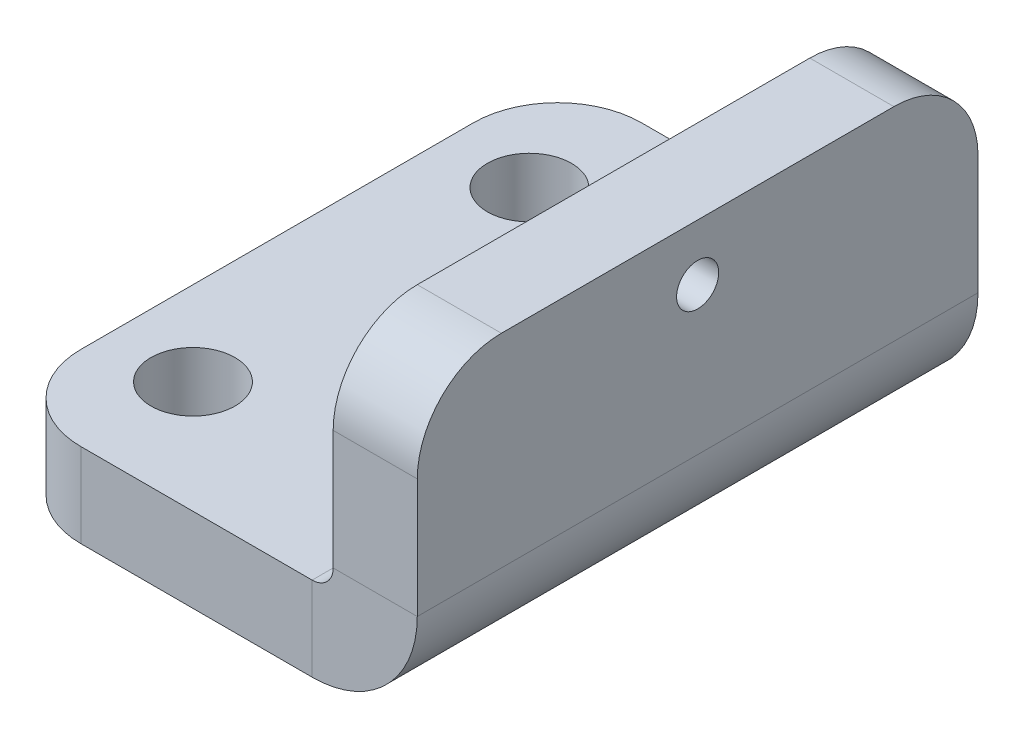
ISO-10303-21;
HEADER;
FILE_DESCRIPTION(('STEP AP214'),'2;1');
FILE_NAME('part.step','',(''),(''),'','','');
FILE_SCHEMA(('AUTOMOTIVE_DESIGN { 1 0 10303 214 1 1 1 1 }'));
ENDSEC;
DATA;
#1=APPLICATION_CONTEXT('core data for automotive mechanical design processes');
#2=APPLICATION_PROTOCOL_DEFINITION('international standard','automotive_design',2000,#1);
#3=PRODUCT_CONTEXT('',#1,'mechanical');
#4=PRODUCT('Part','Part','',(#3));
#5=PRODUCT_RELATED_PRODUCT_CATEGORY('part','',(#4));
#6=PRODUCT_DEFINITION_FORMATION('','',#4);
#7=PRODUCT_DEFINITION_CONTEXT('part definition',#1,'design');
#8=PRODUCT_DEFINITION('design','',#6,#7);
#9=PRODUCT_DEFINITION_SHAPE('','',#8);
#10=(LENGTH_UNIT() NAMED_UNIT(*) SI_UNIT(.MILLI.,.METRE.));
#11=(NAMED_UNIT(*) PLANE_ANGLE_UNIT() SI_UNIT($,.RADIAN.));
#12=(NAMED_UNIT(*) SI_UNIT($,.STERADIAN.) SOLID_ANGLE_UNIT());
#13=UNCERTAINTY_MEASURE_WITH_UNIT(LENGTH_MEASURE(1.E-05),#10,'distance_accuracy_value','');
#14=(GEOMETRIC_REPRESENTATION_CONTEXT(3) GLOBAL_UNCERTAINTY_ASSIGNED_CONTEXT((#13)) GLOBAL_UNIT_ASSIGNED_CONTEXT((#10,
#11,#12)) REPRESENTATION_CONTEXT('',''));
#15=CARTESIAN_POINT('',(0.,0.,0.));
#16=DIRECTION('',(0.,0.,1.));
#17=DIRECTION('',(1.,0.,0.));
#18=AXIS2_PLACEMENT_3D('',#15,#16,#17);
#19=CARTESIAN_POINT('',(0.,0.75,10.));
#20=DIRECTION('',(0.,0.,1.));
#21=DIRECTION('',(1.,0.,0.));
#22=AXIS2_PLACEMENT_3D('',#19,#20,#21);
#23=PLANE('',#22);
#24=DIRECTION('',(1.,0.,0.));
#25=VECTOR('',#24,1.);
#26=CARTESIAN_POINT('',(0.,0.75,10.));
#27=LINE('',#26,#25);
#28=CARTESIAN_POINT('',(0.,0.75,10.));
#29=VERTEX_POINT('',#28);
#30=CARTESIAN_POINT('',(3.,0.75,10.));
#31=VERTEX_POINT('',#30);
#32=EDGE_CURVE('E132',#29,#31,#27,.T.);
#33=ORIENTED_EDGE('',*,*,#32,.F.);
#34=CARTESIAN_POINT('',(-0.75,0.75,10.));
#35=DIRECTION('',(0.,0.,-1.));
#36=DIRECTION('',(-1.,0.,0.));
#37=AXIS2_PLACEMENT_3D('',#34,#35,#36);
#38=CIRCLE('',#37,0.75);
#39=CARTESIAN_POINT('',(-0.750000000000001,0.,10.));
#40=VERTEX_POINT('',#39);
#41=EDGE_CURVE('E136',#40,#29,#38,.F.);
#42=ORIENTED_EDGE('',*,*,#41,.F.);
#43=DIRECTION('',(0.,1.,0.));
#44=VECTOR('',#43,1.);
#45=CARTESIAN_POINT('',(-0.750000000000001,-3.,10.));
#46=LINE('',#45,#44);
#47=CARTESIAN_POINT('',(-0.750000000000001,-3.,10.));
#48=VERTEX_POINT('',#47);
#49=EDGE_CURVE('E141',#48,#40,#46,.T.);
#50=ORIENTED_EDGE('',*,*,#49,.F.);
#51=CARTESIAN_POINT('',(-0.75,0.75,10.));
#52=DIRECTION('',(0.,0.,1.));
#53=DIRECTION('',(1.,0.,0.));
#54=AXIS2_PLACEMENT_3D('',#51,#52,#53);
#55=CIRCLE('',#54,3.75);
#56=EDGE_CURVE('E138',#48,#31,#55,.T.);
#57=ORIENTED_EDGE('',*,*,#56,.T.);
#58=EDGE_LOOP('',(#33,#42,#50,#57));
#59=FACE_BOUND('',#58,.T.);
#60=ADVANCED_FACE('F39',(#59),#23,.T.);
#61=CARTESIAN_POINT('',(-0.750000000000001,-3.,10.));
#62=DIRECTION('',(0.,0.,1.));
#63=DIRECTION('',(1.,0.,0.));
#64=AXIS2_PLACEMENT_3D('',#61,#62,#63);
#65=PLANE('',#64);
#66=DIRECTION('',(0.,1.,0.));
#67=VECTOR('',#66,1.);
#68=CARTESIAN_POINT('',(3.,0.,10.));
#69=LINE('',#68,#67);
#70=CARTESIAN_POINT('',(3.,5.,10.));
#71=VERTEX_POINT('',#70);
#72=EDGE_CURVE('E156',#31,#71,#69,.T.);
#73=ORIENTED_EDGE('',*,*,#72,.T.);
#74=DIRECTION('',(1.,0.,0.));
#75=VECTOR('',#74,1.);
#76=CARTESIAN_POINT('',(-0.750000000000001,5.,10.));
#77=LINE('',#76,#75);
#78=CARTESIAN_POINT('',(0.,5.,10.));
#79=VERTEX_POINT('',#78);
#80=EDGE_CURVE('E62',#71,#79,#77,.F.);
#81=ORIENTED_EDGE('',*,*,#80,.T.);
#82=DIRECTION('',(0.,1.,0.));
#83=VECTOR('',#82,1.);
#84=CARTESIAN_POINT('',(0.,0.,10.));
#85=LINE('',#84,#83);
#86=EDGE_CURVE('E146',#29,#79,#85,.T.);
#87=ORIENTED_EDGE('',*,*,#86,.F.);
#88=ORIENTED_EDGE('',*,*,#32,.T.);
#89=EDGE_LOOP('',(#73,#81,#87,#88));
#90=FACE_BOUND('',#89,.T.);
#91=ADVANCED_FACE('F155',(#90),#65,.T.);
#92=CARTESIAN_POINT('',(-0.750000000000001,0.,-10.));
#93=DIRECTION('',(0.,0.,-1.));
#94=DIRECTION('',(-1.,0.,0.));
#95=AXIS2_PLACEMENT_3D('',#92,#93,#94);
#96=PLANE('',#95);
#97=DIRECTION('',(0.,-1.,0.));
#98=VECTOR('',#97,1.);
#99=CARTESIAN_POINT('',(-0.750000000000001,0.,-10.));
#100=LINE('',#99,#98);
#101=CARTESIAN_POINT('',(-0.750000000000001,0.,-10.));
#102=VERTEX_POINT('',#101);
#103=CARTESIAN_POINT('',(-0.750000000000001,-3.,-10.));
#104=VERTEX_POINT('',#103);
#105=EDGE_CURVE('E202',#102,#104,#100,.T.);
#106=ORIENTED_EDGE('',*,*,#105,.F.);
#107=CARTESIAN_POINT('',(-0.75,0.75,-10.));
#108=DIRECTION('',(0.,0.,-1.));
#109=DIRECTION('',(-1.,0.,0.));
#110=AXIS2_PLACEMENT_3D('',#107,#108,#109);
#111=CIRCLE('',#110,0.75);
#112=CARTESIAN_POINT('',(0.,0.75,-10.));
#113=VERTEX_POINT('',#112);
#114=EDGE_CURVE('E175',#102,#113,#111,.F.);
#115=ORIENTED_EDGE('',*,*,#114,.T.);
#116=DIRECTION('',(-1.,0.,0.));
#117=VECTOR('',#116,1.);
#118=CARTESIAN_POINT('',(3.,0.75,-10.));
#119=LINE('',#118,#117);
#120=CARTESIAN_POINT('',(3.,0.75,-10.));
#121=VERTEX_POINT('',#120);
#122=EDGE_CURVE('E200',#121,#113,#119,.T.);
#123=ORIENTED_EDGE('',*,*,#122,.F.);
#124=CARTESIAN_POINT('',(-0.75,0.75,-10.));
#125=DIRECTION('',(0.,0.,1.));
#126=DIRECTION('',(1.,0.,0.));
#127=AXIS2_PLACEMENT_3D('',#124,#125,#126);
#128=CIRCLE('',#127,3.75);
#129=EDGE_CURVE('E181',#104,#121,#128,.T.);
#130=ORIENTED_EDGE('',*,*,#129,.F.);
#131=EDGE_LOOP('',(#106,#115,#123,#130));
#132=FACE_BOUND('',#131,.T.);
#133=ADVANCED_FACE('F286',(#132),#96,.T.);
#134=CARTESIAN_POINT('',(3.,0.75,-10.));
#135=DIRECTION('',(0.,0.,-1.));
#136=DIRECTION('',(-1.,0.,0.));
#137=AXIS2_PLACEMENT_3D('',#134,#135,#136);
#138=PLANE('',#137);
#139=DIRECTION('',(1.,0.,0.));
#140=VECTOR('',#139,1.);
#141=CARTESIAN_POINT('',(-12.,-3.,-10.));
#142=LINE('',#141,#140);
#143=CARTESIAN_POINT('',(-9.,-3.,-10.));
#144=VERTEX_POINT('',#143);
#145=EDGE_CURVE('E179',#144,#104,#142,.T.);
#146=ORIENTED_EDGE('',*,*,#145,.F.);
#147=DIRECTION('',(0.,1.,0.));
#148=VECTOR('',#147,1.);
#149=CARTESIAN_POINT('',(-9.,0.75,-10.));
#150=LINE('',#149,#148);
#151=CARTESIAN_POINT('',(-9.,0.,-10.));
#152=VERTEX_POINT('',#151);
#153=EDGE_CURVE('E140',#144,#152,#150,.T.);
#154=ORIENTED_EDGE('',*,*,#153,.T.);
#155=DIRECTION('',(1.,0.,0.));
#156=VECTOR('',#155,1.);
#157=CARTESIAN_POINT('',(-12.,0.,-10.));
#158=LINE('',#157,#156);
#159=EDGE_CURVE('E177',#152,#102,#158,.T.);
#160=ORIENTED_EDGE('',*,*,#159,.T.);
#161=ORIENTED_EDGE('',*,*,#105,.T.);
#162=EDGE_LOOP('',(#146,#154,#160,#161));
#163=FACE_BOUND('',#162,.T.);
#164=ADVANCED_FACE('F333',(#163),#138,.T.);
#165=CARTESIAN_POINT('',(3.,0.,10.));
#166=DIRECTION('',(-1.,0.,0.));
#167=DIRECTION('',(0.,0.,1.));
#168=AXIS2_PLACEMENT_3D('',#165,#166,#167);
#169=PLANE('',#168);
#170=CARTESIAN_POINT('',(3.,6.,0.));
#171=DIRECTION('',(-1.,0.,0.));
#172=DIRECTION('',(0.,0.,1.));
#173=AXIS2_PLACEMENT_3D('',#170,#171,#172);
#174=CIRCLE('',#173,0.75);
#175=CARTESIAN_POINT('',(3.,6.,0.75));
#176=VERTEX_POINT('',#175);
#177=EDGE_CURVE('E250',#176,#176,#174,.T.);
#178=ORIENTED_EDGE('',*,*,#177,.T.);
#179=EDGE_LOOP('',(#178));
#180=FACE_BOUND('',#179,.T.);
#181=DIRECTION('',(0.,0.,-1.));
#182=VECTOR('',#181,1.);
#183=CARTESIAN_POINT('',(3.,8.,10.));
#184=LINE('',#183,#182);
#185=CARTESIAN_POINT('',(3.,8.,7.));
#186=VERTEX_POINT('',#185);
#187=CARTESIAN_POINT('',(3.,8.,-7.));
#188=VERTEX_POINT('',#187);
#189=EDGE_CURVE('E197',#186,#188,#184,.T.);
#190=ORIENTED_EDGE('',*,*,#189,.F.);
#191=CARTESIAN_POINT('',(3.,5.,7.));
#192=DIRECTION('',(-1.,0.,0.));
#193=DIRECTION('',(0.,0.,1.));
#194=AXIS2_PLACEMENT_3D('',#191,#192,#193);
#195=CIRCLE('',#194,3.);
#196=EDGE_CURVE('E231',#186,#71,#195,.F.);
#197=ORIENTED_EDGE('',*,*,#196,.T.);
#198=ORIENTED_EDGE('',*,*,#72,.F.);
#199=DIRECTION('',(0.,0.,-1.));
#200=VECTOR('',#199,1.);
#201=CARTESIAN_POINT('',(3.,0.75,10.));
#202=LINE('',#201,#200);
#203=EDGE_CURVE('E169',#31,#121,#202,.T.);
#204=ORIENTED_EDGE('',*,*,#203,.T.);
#205=DIRECTION('',(0.,1.,0.));
#206=VECTOR('',#205,1.);
#207=CARTESIAN_POINT('',(3.,0.,-10.));
#208=LINE('',#207,#206);
#209=CARTESIAN_POINT('',(3.,5.,-10.));
#210=VERTEX_POINT('',#209);
#211=EDGE_CURVE('E170',#121,#210,#208,.T.);
#212=ORIENTED_EDGE('',*,*,#211,.T.);
#213=CARTESIAN_POINT('',(3.,5.,-7.));
#214=DIRECTION('',(-1.,0.,0.));
#215=DIRECTION('',(0.,0.,1.));
#216=AXIS2_PLACEMENT_3D('',#213,#214,#215);
#217=CIRCLE('',#216,3.);
#218=EDGE_CURVE('E229',#210,#188,#217,.F.);
#219=ORIENTED_EDGE('',*,*,#218,.T.);
#220=EDGE_LOOP('',(#190,#197,#198,#204,#212,#219));
#221=FACE_BOUND('',#220,.T.);
#222=ADVANCED_FACE('F244',(#180,#221),#169,.F.);
#223=CARTESIAN_POINT('',(0.,8.,10.));
#224=DIRECTION('',(0.,1.,0.));
#225=DIRECTION('',(0.,0.,1.));
#226=AXIS2_PLACEMENT_3D('',#223,#224,#225);
#227=PLANE('',#226);
#228=DIRECTION('',(0.,0.,-1.));
#229=VECTOR('',#228,1.);
#230=CARTESIAN_POINT('',(0.,8.,10.));
#231=LINE('',#230,#229);
#232=CARTESIAN_POINT('',(0.,8.,7.));
#233=VERTEX_POINT('',#232);
#234=CARTESIAN_POINT('',(0.,8.,-7.));
#235=VERTEX_POINT('',#234);
#236=EDGE_CURVE('E152',#233,#235,#231,.T.);
#237=ORIENTED_EDGE('',*,*,#236,.F.);
#238=DIRECTION('',(1.,0.,0.));
#239=VECTOR('',#238,1.);
#240=CARTESIAN_POINT('',(0.,8.,7.));
#241=LINE('',#240,#239);
#242=EDGE_CURVE('E226',#233,#186,#241,.T.);
#243=ORIENTED_EDGE('',*,*,#242,.T.);
#244=ORIENTED_EDGE('',*,*,#189,.T.);
#245=DIRECTION('',(1.,0.,0.));
#246=VECTOR('',#245,1.);
#247=CARTESIAN_POINT('',(0.,8.,-7.));
#248=LINE('',#247,#246);
#249=EDGE_CURVE('E224',#188,#235,#248,.F.);
#250=ORIENTED_EDGE('',*,*,#249,.T.);
#251=EDGE_LOOP('',(#237,#243,#244,#250));
#252=FACE_BOUND('',#251,.T.);
#253=ADVANCED_FACE('F238',(#252),#227,.T.);
#254=CARTESIAN_POINT('',(0.,0.,10.));
#255=DIRECTION('',(-1.,0.,0.));
#256=DIRECTION('',(0.,0.,1.));
#257=AXIS2_PLACEMENT_3D('',#254,#255,#256);
#258=PLANE('',#257);
#259=CARTESIAN_POINT('',(0.,6.,0.));
#260=DIRECTION('',(-1.,0.,0.));
#261=DIRECTION('',(0.,0.,1.));
#262=AXIS2_PLACEMENT_3D('',#259,#260,#261);
#263=CIRCLE('',#262,0.75);
#264=CARTESIAN_POINT('',(0.,6.,0.75));
#265=VERTEX_POINT('',#264);
#266=EDGE_CURVE('E258',#265,#265,#263,.T.);
#267=ORIENTED_EDGE('',*,*,#266,.F.);
#268=EDGE_LOOP('',(#267));
#269=FACE_BOUND('',#268,.T.);
#270=ORIENTED_EDGE('',*,*,#86,.T.);
#271=CARTESIAN_POINT('',(0.,5.,7.));
#272=DIRECTION('',(-1.,0.,0.));
#273=DIRECTION('',(0.,0.,1.));
#274=AXIS2_PLACEMENT_3D('',#271,#272,#273);
#275=CIRCLE('',#274,3.);
#276=EDGE_CURVE('E47',#79,#233,#275,.T.);
#277=ORIENTED_EDGE('',*,*,#276,.T.);
#278=ORIENTED_EDGE('',*,*,#236,.T.);
#279=CARTESIAN_POINT('',(0.,5.,-7.));
#280=DIRECTION('',(-1.,0.,0.));
#281=DIRECTION('',(0.,0.,1.));
#282=AXIS2_PLACEMENT_3D('',#279,#280,#281);
#283=CIRCLE('',#282,3.);
#284=CARTESIAN_POINT('',(0.,5.,-10.));
#285=VERTEX_POINT('',#284);
#286=EDGE_CURVE('E54',#235,#285,#283,.T.);
#287=ORIENTED_EDGE('',*,*,#286,.T.);
#288=DIRECTION('',(0.,1.,0.));
#289=VECTOR('',#288,1.);
#290=CARTESIAN_POINT('',(0.,0.,-10.));
#291=LINE('',#290,#289);
#292=EDGE_CURVE('E148',#113,#285,#291,.T.);
#293=ORIENTED_EDGE('',*,*,#292,.F.);
#294=DIRECTION('',(0.,0.,-1.));
#295=VECTOR('',#294,1.);
#296=CARTESIAN_POINT('',(0.,0.75,10.));
#297=LINE('',#296,#295);
#298=EDGE_CURVE('E144',#29,#113,#297,.T.);
#299=ORIENTED_EDGE('',*,*,#298,.F.);
#300=EDGE_LOOP('',(#270,#277,#278,#287,#293,#299));
#301=FACE_BOUND('',#300,.T.);
#302=ADVANCED_FACE('F145',(#269,#301),#258,.T.);
#303=CARTESIAN_POINT('',(-0.75,0.75,10.));
#304=DIRECTION('',(0.,0.,-1.));
#305=DIRECTION('',(-1.,0.,0.));
#306=AXIS2_PLACEMENT_3D('',#303,#304,#305);
#307=CYLINDRICAL_SURFACE('',#306,0.75);
#308=ORIENTED_EDGE('',*,*,#114,.F.);
#309=DIRECTION('',(0.,0.,-1.));
#310=VECTOR('',#309,1.);
#311=CARTESIAN_POINT('',(-0.750000000000001,0.,10.));
#312=LINE('',#311,#310);
#313=EDGE_CURVE('E153',#40,#102,#312,.T.);
#314=ORIENTED_EDGE('',*,*,#313,.F.);
#315=ORIENTED_EDGE('',*,*,#41,.T.);
#316=ORIENTED_EDGE('',*,*,#298,.T.);
#317=EDGE_LOOP('',(#308,#314,#315,#316));
#318=FACE_BOUND('',#317,.T.);
#319=ADVANCED_FACE('F159',(#318),#307,.F.);
#320=CARTESIAN_POINT('',(-12.,0.,10.));
#321=DIRECTION('',(0.,1.,0.));
#322=DIRECTION('',(0.,0.,1.));
#323=AXIS2_PLACEMENT_3D('',#320,#321,#322);
#324=PLANE('',#323);
#325=CARTESIAN_POINT('',(-9.,0.,-6.));
#326=DIRECTION('',(0.,1.,0.));
#327=DIRECTION('',(0.,0.,1.));
#328=AXIS2_PLACEMENT_3D('',#325,#326,#327);
#329=CIRCLE('',#328,1.5);
#330=CARTESIAN_POINT('',(-9.,0.,-4.5));
#331=VERTEX_POINT('',#330);
#332=EDGE_CURVE('E253',#331,#331,#329,.T.);
#333=ORIENTED_EDGE('',*,*,#332,.F.);
#334=EDGE_LOOP('',(#333));
#335=FACE_BOUND('',#334,.T.);
#336=CARTESIAN_POINT('',(-9.,0.,6.));
#337=DIRECTION('',(0.,1.,0.));
#338=DIRECTION('',(0.,0.,-1.));
#339=AXIS2_PLACEMENT_3D('',#336,#337,#338);
#340=CIRCLE('',#339,1.5);
#341=CARTESIAN_POINT('',(-9.,0.,4.5));
#342=VERTEX_POINT('',#341);
#343=EDGE_CURVE('E246',#342,#342,#340,.T.);
#344=ORIENTED_EDGE('',*,*,#343,.F.);
#345=EDGE_LOOP('',(#344));
#346=FACE_BOUND('',#345,.T.);
#347=ORIENTED_EDGE('',*,*,#159,.F.);
#348=CARTESIAN_POINT('',(-9.,0.,-7.));
#349=DIRECTION('',(0.,1.,0.));
#350=DIRECTION('',(0.,0.,1.));
#351=AXIS2_PLACEMENT_3D('',#348,#349,#350);
#352=CIRCLE('',#351,3.);
#353=CARTESIAN_POINT('',(-12.,0.,-7.));
#354=VERTEX_POINT('',#353);
#355=EDGE_CURVE('E211',#152,#354,#352,.T.);
#356=ORIENTED_EDGE('',*,*,#355,.T.);
#357=DIRECTION('',(0.,0.,-1.));
#358=VECTOR('',#357,1.);
#359=CARTESIAN_POINT('',(-12.,0.,10.));
#360=LINE('',#359,#358);
#361=CARTESIAN_POINT('',(-12.,0.,7.));
#362=VERTEX_POINT('',#361);
#363=EDGE_CURVE('E192',#362,#354,#360,.T.);
#364=ORIENTED_EDGE('',*,*,#363,.F.);
#365=CARTESIAN_POINT('',(-9.,0.,7.));
#366=DIRECTION('',(0.,1.,0.));
#367=DIRECTION('',(0.,0.,1.));
#368=AXIS2_PLACEMENT_3D('',#365,#366,#367);
#369=CIRCLE('',#368,3.);
#370=CARTESIAN_POINT('',(-9.,0.,10.));
#371=VERTEX_POINT('',#370);
#372=EDGE_CURVE('E209',#362,#371,#369,.T.);
#373=ORIENTED_EDGE('',*,*,#372,.T.);
#374=DIRECTION('',(1.,0.,0.));
#375=VECTOR('',#374,1.);
#376=CARTESIAN_POINT('',(-12.,0.,10.));
#377=LINE('',#376,#375);
#378=EDGE_CURVE('E161',#371,#40,#377,.T.);
#379=ORIENTED_EDGE('',*,*,#378,.T.);
#380=ORIENTED_EDGE('',*,*,#313,.T.);
#381=EDGE_LOOP('',(#347,#356,#364,#373,#379,#380));
#382=FACE_BOUND('',#381,.T.);
#383=ADVANCED_FACE('F278',(#335,#346,#382),#324,.T.);
#384=CARTESIAN_POINT('',(-12.,-3.,10.));
#385=DIRECTION('',(-1.,0.,0.));
#386=DIRECTION('',(0.,0.,1.));
#387=AXIS2_PLACEMENT_3D('',#384,#385,#386);
#388=PLANE('',#387);
#389=ORIENTED_EDGE('',*,*,#363,.T.);
#390=DIRECTION('',(0.,1.,0.));
#391=VECTOR('',#390,1.);
#392=CARTESIAN_POINT('',(-12.,-3.,-7.));
#393=LINE('',#392,#391);
#394=CARTESIAN_POINT('',(-12.,-3.,-7.));
#395=VERTEX_POINT('',#394);
#396=EDGE_CURVE('E216',#354,#395,#393,.F.);
#397=ORIENTED_EDGE('',*,*,#396,.T.);
#398=DIRECTION('',(0.,0.,-1.));
#399=VECTOR('',#398,1.);
#400=CARTESIAN_POINT('',(-12.,-3.,10.));
#401=LINE('',#400,#399);
#402=CARTESIAN_POINT('',(-12.,-3.,7.));
#403=VERTEX_POINT('',#402);
#404=EDGE_CURVE('E189',#403,#395,#401,.T.);
#405=ORIENTED_EDGE('',*,*,#404,.F.);
#406=DIRECTION('',(0.,1.,0.));
#407=VECTOR('',#406,1.);
#408=CARTESIAN_POINT('',(-12.,0.,7.));
#409=LINE('',#408,#407);
#410=EDGE_CURVE('E213',#403,#362,#409,.T.);
#411=ORIENTED_EDGE('',*,*,#410,.T.);
#412=EDGE_LOOP('',(#389,#397,#405,#411));
#413=FACE_BOUND('',#412,.T.);
#414=ADVANCED_FACE('F336',(#413),#388,.T.);
#415=CARTESIAN_POINT('',(-12.,-3.,10.));
#416=DIRECTION('',(0.,1.,0.));
#417=DIRECTION('',(0.,0.,1.));
#418=AXIS2_PLACEMENT_3D('',#415,#416,#417);
#419=PLANE('',#418);
#420=CARTESIAN_POINT('',(-9.,-3.,-6.));
#421=DIRECTION('',(0.,1.,0.));
#422=DIRECTION('',(0.,0.,1.));
#423=AXIS2_PLACEMENT_3D('',#420,#421,#422);
#424=CIRCLE('',#423,1.5);
#425=CARTESIAN_POINT('',(-9.,-3.,-4.5));
#426=VERTEX_POINT('',#425);
#427=EDGE_CURVE('E173',#426,#426,#424,.T.);
#428=ORIENTED_EDGE('',*,*,#427,.T.);
#429=EDGE_LOOP('',(#428));
#430=FACE_BOUND('',#429,.T.);
#431=CARTESIAN_POINT('',(-9.,-3.,6.));
#432=DIRECTION('',(0.,1.,0.));
#433=DIRECTION('',(0.,0.,-1.));
#434=AXIS2_PLACEMENT_3D('',#431,#432,#433);
#435=CIRCLE('',#434,1.5);
#436=CARTESIAN_POINT('',(-9.,-3.,4.5));
#437=VERTEX_POINT('',#436);
#438=EDGE_CURVE('E249',#437,#437,#435,.T.);
#439=ORIENTED_EDGE('',*,*,#438,.T.);
#440=EDGE_LOOP('',(#439));
#441=FACE_BOUND('',#440,.T.);
#442=ORIENTED_EDGE('',*,*,#404,.T.);
#443=CARTESIAN_POINT('',(-9.,-3.,-7.));
#444=DIRECTION('',(0.,1.,0.));
#445=DIRECTION('',(0.,0.,1.));
#446=AXIS2_PLACEMENT_3D('',#443,#444,#445);
#447=CIRCLE('',#446,3.);
#448=EDGE_CURVE('E220',#395,#144,#447,.F.);
#449=ORIENTED_EDGE('',*,*,#448,.T.);
#450=ORIENTED_EDGE('',*,*,#145,.T.);
#451=DIRECTION('',(0.,0.,-1.));
#452=VECTOR('',#451,1.);
#453=CARTESIAN_POINT('',(-0.750000000000001,-3.,10.));
#454=LINE('',#453,#452);
#455=EDGE_CURVE('E186',#48,#104,#454,.T.);
#456=ORIENTED_EDGE('',*,*,#455,.F.);
#457=DIRECTION('',(1.,0.,0.));
#458=VECTOR('',#457,1.);
#459=CARTESIAN_POINT('',(-12.,-3.,10.));
#460=LINE('',#459,#458);
#461=CARTESIAN_POINT('',(-9.,-3.,10.));
#462=VERTEX_POINT('',#461);
#463=EDGE_CURVE('E163',#462,#48,#460,.T.);
#464=ORIENTED_EDGE('',*,*,#463,.F.);
#465=CARTESIAN_POINT('',(-9.,-3.,7.));
#466=DIRECTION('',(0.,1.,0.));
#467=DIRECTION('',(0.,0.,1.));
#468=AXIS2_PLACEMENT_3D('',#465,#466,#467);
#469=CIRCLE('',#468,3.);
#470=EDGE_CURVE('E218',#462,#403,#469,.F.);
#471=ORIENTED_EDGE('',*,*,#470,.T.);
#472=EDGE_LOOP('',(#442,#449,#450,#456,#464,#471));
#473=FACE_BOUND('',#472,.T.);
#474=ADVANCED_FACE('F329',(#430,#441,#473),#419,.F.);
#475=CARTESIAN_POINT('',(-0.75,0.75,10.));
#476=DIRECTION('',(0.,0.,-1.));
#477=DIRECTION('',(-1.,0.,0.));
#478=AXIS2_PLACEMENT_3D('',#475,#476,#477);
#479=CYLINDRICAL_SURFACE('',#478,3.75);
#480=ORIENTED_EDGE('',*,*,#129,.T.);
#481=ORIENTED_EDGE('',*,*,#203,.F.);
#482=ORIENTED_EDGE('',*,*,#56,.F.);
#483=ORIENTED_EDGE('',*,*,#455,.T.);
#484=EDGE_LOOP('',(#480,#481,#482,#483));
#485=FACE_BOUND('',#484,.T.);
#486=ADVANCED_FACE('F313',(#485),#479,.T.);
#487=CARTESIAN_POINT('',(-0.75,0.75,10.));
#488=DIRECTION('',(0.,0.,-1.));
#489=DIRECTION('',(-1.,0.,0.));
#490=AXIS2_PLACEMENT_3D('',#487,#488,#489);
#491=PLANE('',#490);
#492=ORIENTED_EDGE('',*,*,#378,.F.);
#493=DIRECTION('',(0.,1.,0.));
#494=VECTOR('',#493,1.);
#495=CARTESIAN_POINT('',(-9.,-3.,10.));
#496=LINE('',#495,#494);
#497=EDGE_CURVE('E222',#371,#462,#496,.F.);
#498=ORIENTED_EDGE('',*,*,#497,.T.);
#499=ORIENTED_EDGE('',*,*,#463,.T.);
#500=ORIENTED_EDGE('',*,*,#49,.T.);
#501=EDGE_LOOP('',(#492,#498,#499,#500));
#502=FACE_BOUND('',#501,.T.);
#503=ADVANCED_FACE('F326',(#502),#491,.F.);
#504=CARTESIAN_POINT('',(-0.75,0.75,-10.));
#505=DIRECTION('',(0.,0.,-1.));
#506=DIRECTION('',(-1.,0.,0.));
#507=AXIS2_PLACEMENT_3D('',#504,#505,#506);
#508=PLANE('',#507);
#509=ORIENTED_EDGE('',*,*,#292,.T.);
#510=DIRECTION('',(1.,0.,0.));
#511=VECTOR('',#510,1.);
#512=CARTESIAN_POINT('',(-0.75,5.,-10.));
#513=LINE('',#512,#511);
#514=EDGE_CURVE('E11',#285,#210,#513,.T.);
#515=ORIENTED_EDGE('',*,*,#514,.T.);
#516=ORIENTED_EDGE('',*,*,#211,.F.);
#517=ORIENTED_EDGE('',*,*,#122,.T.);
#518=EDGE_LOOP('',(#509,#515,#516,#517));
#519=FACE_BOUND('',#518,.T.);
#520=ADVANCED_FACE('F294',(#519),#508,.T.);
#521=CARTESIAN_POINT('',(-9.,0.75,-7.));
#522=DIRECTION('',(0.,1.,0.));
#523=DIRECTION('',(0.,0.,1.));
#524=AXIS2_PLACEMENT_3D('',#521,#522,#523);
#525=CYLINDRICAL_SURFACE('',#524,3.);
#526=ORIENTED_EDGE('',*,*,#448,.F.);
#527=ORIENTED_EDGE('',*,*,#396,.F.);
#528=ORIENTED_EDGE('',*,*,#355,.F.);
#529=ORIENTED_EDGE('',*,*,#153,.F.);
#530=EDGE_LOOP('',(#526,#527,#528,#529));
#531=FACE_BOUND('',#530,.T.);
#532=ADVANCED_FACE('F290',(#531),#525,.T.);
#533=CARTESIAN_POINT('',(-9.,-3.,7.));
#534=DIRECTION('',(0.,-1.,0.));
#535=DIRECTION('',(0.,0.,-1.));
#536=AXIS2_PLACEMENT_3D('',#533,#534,#535);
#537=CYLINDRICAL_SURFACE('',#536,3.);
#538=ORIENTED_EDGE('',*,*,#470,.F.);
#539=ORIENTED_EDGE('',*,*,#497,.F.);
#540=ORIENTED_EDGE('',*,*,#372,.F.);
#541=ORIENTED_EDGE('',*,*,#410,.F.);
#542=EDGE_LOOP('',(#538,#539,#540,#541));
#543=FACE_BOUND('',#542,.T.);
#544=ADVANCED_FACE('F293',(#543),#537,.T.);
#545=CARTESIAN_POINT('',(0.,5.,7.));
#546=DIRECTION('',(1.,0.,0.));
#547=DIRECTION('',(0.,0.,-1.));
#548=AXIS2_PLACEMENT_3D('',#545,#546,#547);
#549=CYLINDRICAL_SURFACE('',#548,3.);
#550=ORIENTED_EDGE('',*,*,#276,.F.);
#551=ORIENTED_EDGE('',*,*,#80,.F.);
#552=ORIENTED_EDGE('',*,*,#196,.F.);
#553=ORIENTED_EDGE('',*,*,#242,.F.);
#554=EDGE_LOOP('',(#550,#551,#552,#553));
#555=FACE_BOUND('',#554,.T.);
#556=ADVANCED_FACE('F241',(#555),#549,.T.);
#557=CARTESIAN_POINT('',(-0.75,5.,-7.));
#558=DIRECTION('',(1.,0.,0.));
#559=DIRECTION('',(0.,0.,-1.));
#560=AXIS2_PLACEMENT_3D('',#557,#558,#559);
#561=CYLINDRICAL_SURFACE('',#560,3.);
#562=ORIENTED_EDGE('',*,*,#286,.F.);
#563=ORIENTED_EDGE('',*,*,#249,.F.);
#564=ORIENTED_EDGE('',*,*,#218,.F.);
#565=ORIENTED_EDGE('',*,*,#514,.F.);
#566=EDGE_LOOP('',(#562,#563,#564,#565));
#567=FACE_BOUND('',#566,.T.);
#568=ADVANCED_FACE('F41',(#567),#561,.T.);
#569=CARTESIAN_POINT('',(-9.,-3.,6.));
#570=DIRECTION('',(0.,1.,0.));
#571=DIRECTION('',(0.,0.,1.));
#572=AXIS2_PLACEMENT_3D('',#569,#570,#571);
#573=CYLINDRICAL_SURFACE('',#572,1.5);
#574=ORIENTED_EDGE('',*,*,#438,.F.);
#575=EDGE_LOOP('',(#574));
#576=FACE_BOUND('',#575,.T.);
#577=ORIENTED_EDGE('',*,*,#343,.T.);
#578=EDGE_LOOP('',(#577));
#579=FACE_BOUND('',#578,.T.);
#580=ADVANCED_FACE('F302',(#576,#579),#573,.F.);
#581=CARTESIAN_POINT('',(-9.,-3.,-6.));
#582=DIRECTION('',(0.,1.,0.));
#583=DIRECTION('',(0.,0.,1.));
#584=AXIS2_PLACEMENT_3D('',#581,#582,#583);
#585=CYLINDRICAL_SURFACE('',#584,1.5);
#586=ORIENTED_EDGE('',*,*,#427,.F.);
#587=EDGE_LOOP('',(#586));
#588=FACE_BOUND('',#587,.T.);
#589=ORIENTED_EDGE('',*,*,#332,.T.);
#590=EDGE_LOOP('',(#589));
#591=FACE_BOUND('',#590,.T.);
#592=ADVANCED_FACE('F268',(#588,#591),#585,.F.);
#593=CARTESIAN_POINT('',(3.,6.,0.));
#594=DIRECTION('',(-1.,0.,0.));
#595=DIRECTION('',(0.,0.,1.));
#596=AXIS2_PLACEMENT_3D('',#593,#594,#595);
#597=CYLINDRICAL_SURFACE('',#596,0.75);
#598=ORIENTED_EDGE('',*,*,#177,.F.);
#599=EDGE_LOOP('',(#598));
#600=FACE_BOUND('',#599,.T.);
#601=ORIENTED_EDGE('',*,*,#266,.T.);
#602=EDGE_LOOP('',(#601));
#603=FACE_BOUND('',#602,.T.);
#604=ADVANCED_FACE('F265',(#600,#603),#597,.F.);
#605=CLOSED_SHELL('',(#60,#91,#133,#164,#222,#253,#302,#319,#383,#414,#474,#486,#503,#520,#532,
#544,#556,#568,#580,#592,#604));
#606=MANIFOLD_SOLID_BREP('B2',#605);
#607=ADVANCED_BREP_SHAPE_REPRESENTATION('',(#18,#606),#14);
#608=SHAPE_DEFINITION_REPRESENTATION(#9,#607);
ENDSEC;
END-ISO-10303-21;
